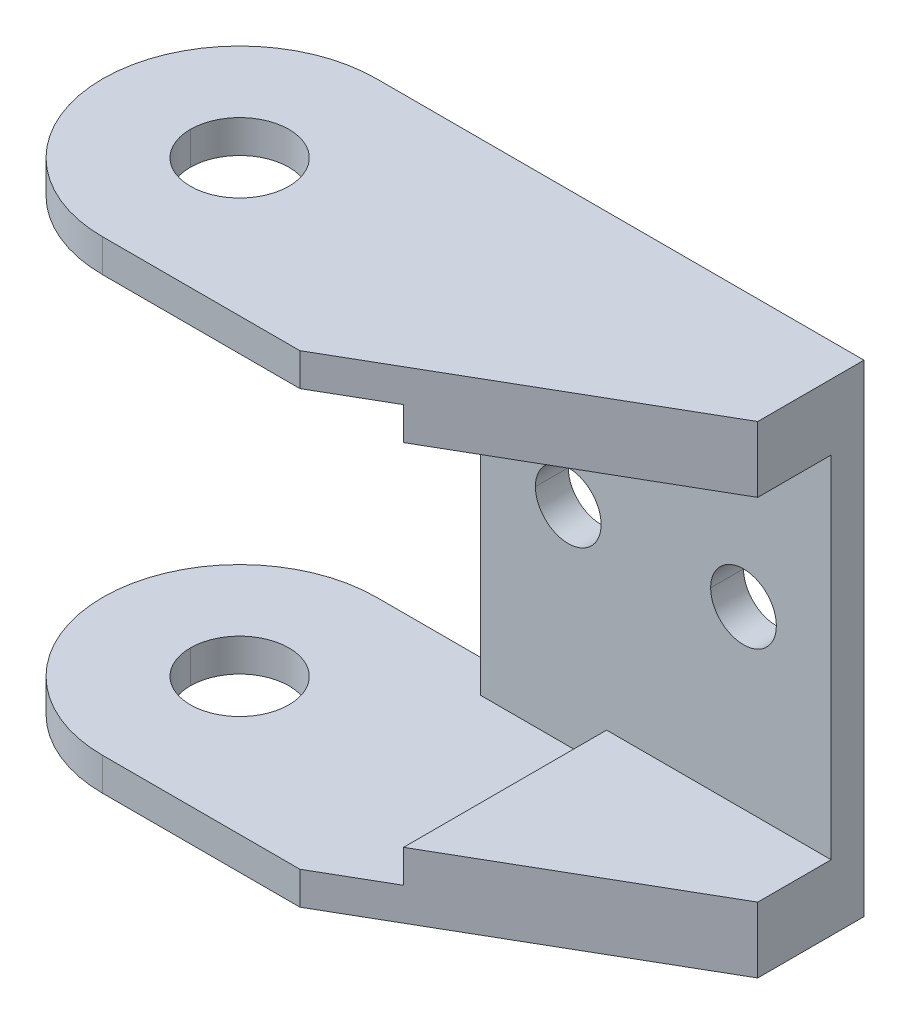
ISO-10303-21;
HEADER;
FILE_DESCRIPTION(('STEP AP214'),'2;1');
FILE_NAME('part.step','',(''),(''),'','','');
FILE_SCHEMA(('AUTOMOTIVE_DESIGN { 1 0 10303 214 1 1 1 1 }'));
ENDSEC;
DATA;
#1=APPLICATION_CONTEXT('core data for automotive mechanical design processes');
#2=APPLICATION_PROTOCOL_DEFINITION('international standard','automotive_design',2000,#1);
#3=PRODUCT_CONTEXT('',#1,'mechanical');
#4=PRODUCT('Part','Part','',(#3));
#5=PRODUCT_RELATED_PRODUCT_CATEGORY('part','',(#4));
#6=PRODUCT_DEFINITION_FORMATION('','',#4);
#7=PRODUCT_DEFINITION_CONTEXT('part definition',#1,'design');
#8=PRODUCT_DEFINITION('design','',#6,#7);
#9=PRODUCT_DEFINITION_SHAPE('','',#8);
#10=(LENGTH_UNIT() NAMED_UNIT(*) SI_UNIT(.MILLI.,.METRE.));
#11=(NAMED_UNIT(*) PLANE_ANGLE_UNIT() SI_UNIT($,.RADIAN.));
#12=(NAMED_UNIT(*) SI_UNIT($,.STERADIAN.) SOLID_ANGLE_UNIT());
#13=UNCERTAINTY_MEASURE_WITH_UNIT(LENGTH_MEASURE(1.E-05),#10,'distance_accuracy_value','');
#14=(GEOMETRIC_REPRESENTATION_CONTEXT(3) GLOBAL_UNCERTAINTY_ASSIGNED_CONTEXT((#13)) GLOBAL_UNIT_ASSIGNED_CONTEXT((#10,
#11,#12)) REPRESENTATION_CONTEXT('',''));
#15=CARTESIAN_POINT('',(0.,0.,0.));
#16=DIRECTION('',(0.,0.,1.));
#17=DIRECTION('',(1.,0.,0.));
#18=AXIS2_PLACEMENT_3D('',#15,#16,#17);
#19=CARTESIAN_POINT('',(0.,0.,0.));
#20=DIRECTION('',(0.,1.,0.));
#21=DIRECTION('',(1.,0.,0.));
#22=AXIS2_PLACEMENT_3D('',#19,#20,#21);
#23=CYLINDRICAL_SURFACE('',#22,2.25);
#24=DIRECTION('',(0.,-1.,0.));
#25=VECTOR('',#24,1.);
#26=CARTESIAN_POINT('',(2.25,-10.25,0.));
#27=LINE('',#26,#25);
#28=CARTESIAN_POINT('',(2.25,-9.5,0.));
#29=VERTEX_POINT('',#28);
#30=CARTESIAN_POINT('',(2.25,-11.,0.));
#31=VERTEX_POINT('',#30);
#32=EDGE_CURVE('E41',#29,#31,#27,.T.);
#33=ORIENTED_EDGE('',*,*,#32,.F.);
#34=CARTESIAN_POINT('',(0.,-9.5,0.));
#35=DIRECTION('',(0.,-1.,0.));
#36=DIRECTION('',(1.,0.,0.));
#37=AXIS2_PLACEMENT_3D('',#34,#35,#36);
#38=CIRCLE('',#37,2.25);
#39=CARTESIAN_POINT('',(-2.25,-9.5,0.));
#40=VERTEX_POINT('',#39);
#41=EDGE_CURVE('E281',#40,#29,#38,.T.);
#42=ORIENTED_EDGE('',*,*,#41,.F.);
#43=DIRECTION('',(0.,1.,0.));
#44=VECTOR('',#43,1.);
#45=CARTESIAN_POINT('',(-2.25,-10.25,0.));
#46=LINE('',#45,#44);
#47=CARTESIAN_POINT('',(-2.25,-11.,0.));
#48=VERTEX_POINT('',#47);
#49=EDGE_CURVE('E352',#48,#40,#46,.T.);
#50=ORIENTED_EDGE('',*,*,#49,.F.);
#51=CARTESIAN_POINT('',(0.,-11.,0.));
#52=DIRECTION('',(0.,1.,0.));
#53=DIRECTION('',(1.,0.,0.));
#54=AXIS2_PLACEMENT_3D('',#51,#52,#53);
#55=CIRCLE('',#54,2.25);
#56=EDGE_CURVE('E347',#31,#48,#55,.T.);
#57=ORIENTED_EDGE('',*,*,#56,.F.);
#58=EDGE_LOOP('',(#33,#42,#50,#57));
#59=FACE_BOUND('',#58,.T.);
#60=ADVANCED_FACE('F16',(#59),#23,.F.);
#61=CARTESIAN_POINT('',(0.,0.,0.));
#62=DIRECTION('',(0.,1.,0.));
#63=DIRECTION('',(1.,0.,0.));
#64=AXIS2_PLACEMENT_3D('',#61,#62,#63);
#65=CYLINDRICAL_SURFACE('',#64,2.25);
#66=DIRECTION('',(0.,-1.,0.));
#67=VECTOR('',#66,1.);
#68=CARTESIAN_POINT('',(2.25,10.25,0.));
#69=LINE('',#68,#67);
#70=CARTESIAN_POINT('',(2.25,11.,0.));
#71=VERTEX_POINT('',#70);
#72=CARTESIAN_POINT('',(2.25,9.5,0.));
#73=VERTEX_POINT('',#72);
#74=EDGE_CURVE('E257',#71,#73,#69,.T.);
#75=ORIENTED_EDGE('',*,*,#74,.F.);
#76=CARTESIAN_POINT('',(0.,11.,0.));
#77=DIRECTION('',(0.,-1.,0.));
#78=DIRECTION('',(1.,0.,0.));
#79=AXIS2_PLACEMENT_3D('',#76,#77,#78);
#80=CIRCLE('',#79,2.25);
#81=CARTESIAN_POINT('',(-2.25,11.,0.));
#82=VERTEX_POINT('',#81);
#83=EDGE_CURVE('E251',#82,#71,#80,.T.);
#84=ORIENTED_EDGE('',*,*,#83,.F.);
#85=DIRECTION('',(0.,1.,0.));
#86=VECTOR('',#85,1.);
#87=CARTESIAN_POINT('',(-2.25,10.25,0.));
#88=LINE('',#87,#86);
#89=CARTESIAN_POINT('',(-2.25,9.5,0.));
#90=VERTEX_POINT('',#89);
#91=EDGE_CURVE('E245',#90,#82,#88,.T.);
#92=ORIENTED_EDGE('',*,*,#91,.F.);
#93=CARTESIAN_POINT('',(0.,9.5,0.));
#94=DIRECTION('',(0.,1.,0.));
#95=DIRECTION('',(1.,0.,0.));
#96=AXIS2_PLACEMENT_3D('',#93,#94,#95);
#97=CIRCLE('',#96,2.25);
#98=EDGE_CURVE('E248',#73,#90,#97,.T.);
#99=ORIENTED_EDGE('',*,*,#98,.F.);
#100=EDGE_LOOP('',(#75,#84,#92,#99));
#101=FACE_BOUND('',#100,.T.);
#102=ADVANCED_FACE('F247',(#101),#65,.F.);
#103=CARTESIAN_POINT('',(18.25,0.,-5.5));
#104=DIRECTION('',(0.,0.,1.));
#105=DIRECTION('',(1.,0.,0.));
#106=AXIS2_PLACEMENT_3D('',#103,#104,#105);
#107=CYLINDRICAL_SURFACE('',#106,1.5);
#108=DIRECTION('',(0.,0.,-1.));
#109=VECTOR('',#108,1.);
#110=CARTESIAN_POINT('',(19.75,0.,-5.5));
#111=LINE('',#110,#109);
#112=CARTESIAN_POINT('',(19.75,0.,-4.75));
#113=VERTEX_POINT('',#112);
#114=CARTESIAN_POINT('',(19.75,0.,-6.25));
#115=VERTEX_POINT('',#114);
#116=EDGE_CURVE('E434',#113,#115,#111,.T.);
#117=ORIENTED_EDGE('',*,*,#116,.F.);
#118=CARTESIAN_POINT('',(18.25,0.,-4.75));
#119=DIRECTION('',(0.,0.,-1.));
#120=DIRECTION('',(1.,0.,0.));
#121=AXIS2_PLACEMENT_3D('',#118,#119,#120);
#122=CIRCLE('',#121,1.5);
#123=CARTESIAN_POINT('',(16.75,0.,-4.75));
#124=VERTEX_POINT('',#123);
#125=EDGE_CURVE('E20',#124,#113,#122,.T.);
#126=ORIENTED_EDGE('',*,*,#125,.F.);
#127=DIRECTION('',(0.,0.,1.));
#128=VECTOR('',#127,1.);
#129=CARTESIAN_POINT('',(16.75,0.,-5.5));
#130=LINE('',#129,#128);
#131=CARTESIAN_POINT('',(16.75,0.,-6.25));
#132=VERTEX_POINT('',#131);
#133=EDGE_CURVE('E308',#132,#124,#130,.T.);
#134=ORIENTED_EDGE('',*,*,#133,.F.);
#135=CARTESIAN_POINT('',(18.25,0.,-6.25));
#136=DIRECTION('',(0.,0.,1.));
#137=DIRECTION('',(1.,0.,0.));
#138=AXIS2_PLACEMENT_3D('',#135,#136,#137);
#139=CIRCLE('',#138,1.5);
#140=EDGE_CURVE('E336',#115,#132,#139,.T.);
#141=ORIENTED_EDGE('',*,*,#140,.F.);
#142=EDGE_LOOP('',(#117,#126,#134,#141));
#143=FACE_BOUND('',#142,.T.);
#144=ADVANCED_FACE('F834',(#143),#107,.F.);
#145=CARTESIAN_POINT('',(10.25,0.,-5.5));
#146=DIRECTION('',(0.,0.,1.));
#147=DIRECTION('',(1.,0.,0.));
#148=AXIS2_PLACEMENT_3D('',#145,#146,#147);
#149=CYLINDRICAL_SURFACE('',#148,1.5);
#150=DIRECTION('',(0.,0.,-1.));
#151=VECTOR('',#150,1.);
#152=CARTESIAN_POINT('',(11.75,0.,-5.5));
#153=LINE('',#152,#151);
#154=CARTESIAN_POINT('',(11.75,0.,-4.75));
#155=VERTEX_POINT('',#154);
#156=CARTESIAN_POINT('',(11.75,0.,-6.25));
#157=VERTEX_POINT('',#156);
#158=EDGE_CURVE('E11',#155,#157,#153,.T.);
#159=ORIENTED_EDGE('',*,*,#158,.F.);
#160=CARTESIAN_POINT('',(10.25,0.,-4.75));
#161=DIRECTION('',(0.,0.,-1.));
#162=DIRECTION('',(1.,0.,0.));
#163=AXIS2_PLACEMENT_3D('',#160,#161,#162);
#164=CIRCLE('',#163,1.5);
#165=CARTESIAN_POINT('',(8.75,0.,-4.75));
#166=VERTEX_POINT('',#165);
#167=EDGE_CURVE('E286',#166,#155,#164,.T.);
#168=ORIENTED_EDGE('',*,*,#167,.F.);
#169=DIRECTION('',(0.,0.,1.));
#170=VECTOR('',#169,1.);
#171=CARTESIAN_POINT('',(8.75,0.,-5.5));
#172=LINE('',#171,#170);
#173=CARTESIAN_POINT('',(8.75,0.,-6.25));
#174=VERTEX_POINT('',#173);
#175=EDGE_CURVE('E27',#174,#166,#172,.T.);
#176=ORIENTED_EDGE('',*,*,#175,.F.);
#177=CARTESIAN_POINT('',(10.25,0.,-6.25));
#178=DIRECTION('',(0.,0.,1.));
#179=DIRECTION('',(1.,0.,0.));
#180=AXIS2_PLACEMENT_3D('',#177,#178,#179);
#181=CIRCLE('',#180,1.5);
#182=EDGE_CURVE('E377',#157,#174,#181,.T.);
#183=ORIENTED_EDGE('',*,*,#182,.F.);
#184=EDGE_LOOP('',(#159,#168,#176,#183));
#185=FACE_BOUND('',#184,.T.);
#186=ADVANCED_FACE('F432',(#185),#149,.F.);
#187=CARTESIAN_POINT('',(10.25,0.,-5.5));
#188=DIRECTION('',(0.,0.,1.));
#189=DIRECTION('',(1.,0.,0.));
#190=AXIS2_PLACEMENT_3D('',#187,#188,#189);
#191=CYLINDRICAL_SURFACE('',#190,1.5);
#192=ORIENTED_EDGE('',*,*,#158,.T.);
#193=CARTESIAN_POINT('',(10.25,0.,-6.25));
#194=DIRECTION('',(0.,0.,1.));
#195=DIRECTION('',(1.,0.,0.));
#196=AXIS2_PLACEMENT_3D('',#193,#194,#195);
#197=CIRCLE('',#196,1.5);
#198=EDGE_CURVE('E381',#174,#157,#197,.T.);
#199=ORIENTED_EDGE('',*,*,#198,.F.);
#200=ORIENTED_EDGE('',*,*,#175,.T.);
#201=CARTESIAN_POINT('',(10.25,0.,-4.75));
#202=DIRECTION('',(0.,0.,-1.));
#203=DIRECTION('',(1.,0.,0.));
#204=AXIS2_PLACEMENT_3D('',#201,#202,#203);
#205=CIRCLE('',#204,1.5);
#206=EDGE_CURVE('E289',#155,#166,#205,.T.);
#207=ORIENTED_EDGE('',*,*,#206,.F.);
#208=EDGE_LOOP('',(#192,#199,#200,#207));
#209=FACE_BOUND('',#208,.T.);
#210=ADVANCED_FACE('F18',(#209),#191,.F.);
#211=CARTESIAN_POINT('',(18.25,0.,-5.5));
#212=DIRECTION('',(0.,0.,1.));
#213=DIRECTION('',(1.,0.,0.));
#214=AXIS2_PLACEMENT_3D('',#211,#212,#213);
#215=CYLINDRICAL_SURFACE('',#214,1.5);
#216=ORIENTED_EDGE('',*,*,#116,.T.);
#217=CARTESIAN_POINT('',(18.25,0.,-6.25));
#218=DIRECTION('',(0.,0.,1.));
#219=DIRECTION('',(1.,0.,0.));
#220=AXIS2_PLACEMENT_3D('',#217,#218,#219);
#221=CIRCLE('',#220,1.5);
#222=EDGE_CURVE('E332',#132,#115,#221,.T.);
#223=ORIENTED_EDGE('',*,*,#222,.F.);
#224=ORIENTED_EDGE('',*,*,#133,.T.);
#225=CARTESIAN_POINT('',(18.25,0.,-4.75));
#226=DIRECTION('',(0.,0.,-1.));
#227=DIRECTION('',(1.,0.,0.));
#228=AXIS2_PLACEMENT_3D('',#225,#226,#227);
#229=CIRCLE('',#228,1.5);
#230=EDGE_CURVE('E290',#113,#124,#229,.T.);
#231=ORIENTED_EDGE('',*,*,#230,.F.);
#232=EDGE_LOOP('',(#216,#223,#224,#231));
#233=FACE_BOUND('',#232,.T.);
#234=ADVANCED_FACE('F930',(#233),#215,.F.);
#235=CARTESIAN_POINT('',(14.25,-9.5,-4.75));
#236=DIRECTION('',(0.,0.,1.));
#237=DIRECTION('',(1.,0.,0.));
#238=AXIS2_PLACEMENT_3D('',#235,#236,#237);
#239=PLANE('',#238);
#240=DIRECTION('',(0.,-1.,0.));
#241=VECTOR('',#240,1.);
#242=CARTESIAN_POINT('',(12.,-4.75,-4.75));
#243=LINE('',#242,#241);
#244=CARTESIAN_POINT('',(12.,9.5,-4.75));
#245=VERTEX_POINT('',#244);
#246=CARTESIAN_POINT('',(12.,8.,-4.75));
#247=VERTEX_POINT('',#246);
#248=EDGE_CURVE('E264',#245,#247,#243,.T.);
#249=ORIENTED_EDGE('',*,*,#248,.F.);
#250=DIRECTION('',(1.,0.,0.));
#251=VECTOR('',#250,1.);
#252=CARTESIAN_POINT('',(8.5625,9.5,-4.75));
#253=LINE('',#252,#251);
#254=CARTESIAN_POINT('',(6.25,9.5,-4.75));
#255=VERTEX_POINT('',#254);
#256=EDGE_CURVE('E268',#255,#245,#253,.T.);
#257=ORIENTED_EDGE('',*,*,#256,.F.);
#258=DIRECTION('',(0.,1.,0.));
#259=VECTOR('',#258,1.);
#260=CARTESIAN_POINT('',(6.25,-9.5,-4.75));
#261=LINE('',#260,#259);
#262=CARTESIAN_POINT('',(6.25,-9.5,-4.75));
#263=VERTEX_POINT('',#262);
#264=EDGE_CURVE('E484',#263,#255,#261,.T.);
#265=ORIENTED_EDGE('',*,*,#264,.F.);
#266=DIRECTION('',(-1.,0.,0.));
#267=VECTOR('',#266,1.);
#268=CARTESIAN_POINT('',(8.5625,-9.5,-4.75));
#269=LINE('',#268,#267);
#270=CARTESIAN_POINT('',(12.,-9.5,-4.75));
#271=VERTEX_POINT('',#270);
#272=EDGE_CURVE('E209',#271,#263,#269,.T.);
#273=ORIENTED_EDGE('',*,*,#272,.F.);
#274=DIRECTION('',(0.,-1.,0.));
#275=VECTOR('',#274,1.);
#276=CARTESIAN_POINT('',(12.,-4.75,-4.75));
#277=LINE('',#276,#275);
#278=CARTESIAN_POINT('',(12.,-8.,-4.75));
#279=VERTEX_POINT('',#278);
#280=EDGE_CURVE('E221',#279,#271,#277,.T.);
#281=ORIENTED_EDGE('',*,*,#280,.F.);
#282=DIRECTION('',(-1.,0.,0.));
#283=VECTOR('',#282,1.);
#284=CARTESIAN_POINT('',(12.625,-8.,-4.75));
#285=LINE('',#284,#283);
#286=CARTESIAN_POINT('',(22.25,-8.,-4.75));
#287=VERTEX_POINT('',#286);
#288=EDGE_CURVE('E258',#287,#279,#285,.T.);
#289=ORIENTED_EDGE('',*,*,#288,.F.);
#290=DIRECTION('',(0.,1.,0.));
#291=VECTOR('',#290,1.);
#292=CARTESIAN_POINT('',(22.25,-9.5,-4.75));
#293=LINE('',#292,#291);
#294=CARTESIAN_POINT('',(22.25,8.,-4.75));
#295=VERTEX_POINT('',#294);
#296=EDGE_CURVE('E304',#287,#295,#293,.T.);
#297=ORIENTED_EDGE('',*,*,#296,.T.);
#298=DIRECTION('',(1.,0.,0.));
#299=VECTOR('',#298,1.);
#300=CARTESIAN_POINT('',(12.625,8.,-4.75));
#301=LINE('',#300,#299);
#302=EDGE_CURVE('E298',#247,#295,#301,.T.);
#303=ORIENTED_EDGE('',*,*,#302,.F.);
#304=EDGE_LOOP('',(#249,#257,#265,#273,#281,#289,#297,#303));
#305=FACE_BOUND('',#304,.T.);
#306=ORIENTED_EDGE('',*,*,#206,.T.);
#307=ORIENTED_EDGE('',*,*,#167,.T.);
#308=EDGE_LOOP('',(#306,#307));
#309=FACE_BOUND('',#308,.T.);
#310=ORIENTED_EDGE('',*,*,#230,.T.);
#311=ORIENTED_EDGE('',*,*,#125,.T.);
#312=EDGE_LOOP('',(#310,#311));
#313=FACE_BOUND('',#312,.T.);
#314=ADVANCED_FACE('F539',(#305,#309,#313),#239,.T.);
#315=CARTESIAN_POINT('',(6.25,-9.5,-5.5));
#316=DIRECTION('',(-1.,0.,0.));
#317=DIRECTION('',(0.,0.,1.));
#318=AXIS2_PLACEMENT_3D('',#315,#316,#317);
#319=PLANE('',#318);
#320=ORIENTED_EDGE('',*,*,#264,.T.);
#321=DIRECTION('',(0.,0.,1.));
#322=VECTOR('',#321,1.);
#323=CARTESIAN_POINT('',(6.25,9.5,-2.75));
#324=LINE('',#323,#322);
#325=CARTESIAN_POINT('',(6.25,9.5,-6.25));
#326=VERTEX_POINT('',#325);
#327=EDGE_CURVE('E275',#326,#255,#324,.T.);
#328=ORIENTED_EDGE('',*,*,#327,.F.);
#329=DIRECTION('',(0.,1.,0.));
#330=VECTOR('',#329,1.);
#331=CARTESIAN_POINT('',(6.25,-9.5,-6.25));
#332=LINE('',#331,#330);
#333=CARTESIAN_POINT('',(6.25,-9.5,-6.25));
#334=VERTEX_POINT('',#333);
#335=EDGE_CURVE('E361',#334,#326,#332,.T.);
#336=ORIENTED_EDGE('',*,*,#335,.F.);
#337=DIRECTION('',(0.,0.,-1.));
#338=VECTOR('',#337,1.);
#339=CARTESIAN_POINT('',(6.25,-9.5,-2.75));
#340=LINE('',#339,#338);
#341=EDGE_CURVE('E284',#263,#334,#340,.T.);
#342=ORIENTED_EDGE('',*,*,#341,.F.);
#343=EDGE_LOOP('',(#320,#328,#336,#342));
#344=FACE_BOUND('',#343,.T.);
#345=ADVANCED_FACE('F501',(#344),#319,.T.);
#346=CARTESIAN_POINT('',(2.875,9.5,0.));
#347=DIRECTION('',(0.,-1.,0.));
#348=DIRECTION('',(0.,0.,-1.));
#349=AXIS2_PLACEMENT_3D('',#346,#347,#348);
#350=PLANE('',#349);
#351=ORIENTED_EDGE('',*,*,#327,.T.);
#352=ORIENTED_EDGE('',*,*,#256,.T.);
#353=DIRECTION('',(0.,0.,-1.));
#354=VECTOR('',#353,1.);
#355=CARTESIAN_POINT('',(12.,9.5,0.));
#356=LINE('',#355,#354);
#357=CARTESIAN_POINT('',(12.,9.5,4.51794919242264));
#358=VERTEX_POINT('',#357);
#359=EDGE_CURVE('E293',#358,#245,#356,.T.);
#360=ORIENTED_EDGE('',*,*,#359,.F.);
#361=DIRECTION('',(0.866025403783379,0.,-0.500000000001836));
#362=VECTOR('',#361,1.);
#363=CARTESIAN_POINT('',(11.3687896934221,9.5,4.88237863284243));
#364=LINE('',#363,#362);
#365=CARTESIAN_POINT('',(9.,9.5,6.25));
#366=VERTEX_POINT('',#365);
#367=EDGE_CURVE('E358',#366,#358,#364,.T.);
#368=ORIENTED_EDGE('',*,*,#367,.F.);
#369=DIRECTION('',(1.,0.,0.));
#370=VECTOR('',#369,1.);
#371=CARTESIAN_POINT('',(3.6875,9.5,6.25));
#372=LINE('',#371,#370);
#373=CARTESIAN_POINT('',(0.,9.5,6.25));
#374=VERTEX_POINT('',#373);
#375=EDGE_CURVE('E324',#374,#366,#372,.T.);
#376=ORIENTED_EDGE('',*,*,#375,.F.);
#377=CARTESIAN_POINT('',(0.,9.5,0.));
#378=DIRECTION('',(0.,1.,0.));
#379=DIRECTION('',(0.,0.,1.));
#380=AXIS2_PLACEMENT_3D('',#377,#378,#379);
#381=CIRCLE('',#380,6.25);
#382=CARTESIAN_POINT('',(0.,9.5,-6.25));
#383=VERTEX_POINT('',#382);
#384=EDGE_CURVE('E337',#383,#374,#381,.T.);
#385=ORIENTED_EDGE('',*,*,#384,.F.);
#386=DIRECTION('',(-1.,0.,0.));
#387=VECTOR('',#386,1.);
#388=CARTESIAN_POINT('',(7.,9.5,-6.25));
#389=LINE('',#388,#387);
#390=EDGE_CURVE('E364',#326,#383,#389,.T.);
#391=ORIENTED_EDGE('',*,*,#390,.F.);
#392=EDGE_LOOP('',(#351,#352,#360,#368,#376,#385,#391));
#393=FACE_BOUND('',#392,.T.);
#394=CARTESIAN_POINT('',(0.,9.5,0.));
#395=DIRECTION('',(0.,1.,0.));
#396=DIRECTION('',(1.,0.,0.));
#397=AXIS2_PLACEMENT_3D('',#394,#395,#396);
#398=CIRCLE('',#397,2.25);
#399=EDGE_CURVE('E262',#90,#73,#398,.T.);
#400=ORIENTED_EDGE('',*,*,#399,.T.);
#401=ORIENTED_EDGE('',*,*,#98,.T.);
#402=EDGE_LOOP('',(#400,#401));
#403=FACE_BOUND('',#402,.T.);
#404=ADVANCED_FACE('F261',(#393,#403),#350,.T.);
#405=CARTESIAN_POINT('',(12.,0.,0.));
#406=DIRECTION('',(-1.,0.,0.));
#407=DIRECTION('',(0.,0.,1.));
#408=AXIS2_PLACEMENT_3D('',#405,#406,#407);
#409=PLANE('',#408);
#410=ORIENTED_EDGE('',*,*,#248,.T.);
#411=DIRECTION('',(0.,0.,1.));
#412=VECTOR('',#411,1.);
#413=CARTESIAN_POINT('',(12.,8.,0.));
#414=LINE('',#413,#412);
#415=CARTESIAN_POINT('',(12.,8.,4.51794919242264));
#416=VERTEX_POINT('',#415);
#417=EDGE_CURVE('E297',#247,#416,#414,.T.);
#418=ORIENTED_EDGE('',*,*,#417,.T.);
#419=DIRECTION('',(0.,-1.,0.));
#420=VECTOR('',#419,1.);
#421=CARTESIAN_POINT('',(12.,-5.5,4.51794919242264));
#422=LINE('',#421,#420);
#423=EDGE_CURVE('E341',#358,#416,#422,.T.);
#424=ORIENTED_EDGE('',*,*,#423,.F.);
#425=ORIENTED_EDGE('',*,*,#359,.T.);
#426=EDGE_LOOP('',(#410,#418,#424,#425));
#427=FACE_BOUND('',#426,.T.);
#428=ADVANCED_FACE('F788',(#427),#409,.T.);
#429=CARTESIAN_POINT('',(11.,8.,0.));
#430=DIRECTION('',(0.,-1.,0.));
#431=DIRECTION('',(0.,0.,-1.));
#432=AXIS2_PLACEMENT_3D('',#429,#430,#431);
#433=PLANE('',#432);
#434=ORIENTED_EDGE('',*,*,#302,.T.);
#435=DIRECTION('',(0.,0.,-1.));
#436=VECTOR('',#435,1.);
#437=CARTESIAN_POINT('',(22.25,8.,-1.9124727667));
#438=LINE('',#437,#436);
#439=CARTESIAN_POINT('',(22.25,8.,-1.3998910668));
#440=VERTEX_POINT('',#439);
#441=EDGE_CURVE('E371',#440,#295,#438,.T.);
#442=ORIENTED_EDGE('',*,*,#441,.F.);
#443=DIRECTION('',(0.866025403783379,0.,-0.500000000001836));
#444=VECTOR('',#443,1.);
#445=CARTESIAN_POINT('',(14.4156646934147,8.,3.12326453140098));
#446=LINE('',#445,#444);
#447=EDGE_CURVE('E319',#416,#440,#446,.T.);
#448=ORIENTED_EDGE('',*,*,#447,.F.);
#449=ORIENTED_EDGE('',*,*,#417,.F.);
#450=EDGE_LOOP('',(#434,#442,#448,#449));
#451=FACE_BOUND('',#450,.T.);
#452=ADVANCED_FACE('F545',(#451),#433,.T.);
#453=CARTESIAN_POINT('',(15.625,-11.,2.4250544666));
#454=DIRECTION('',(0.500000000001836,0.,0.866025403783379));
#455=DIRECTION('',(0.,-1.,0.));
#456=AXIS2_PLACEMENT_3D('',#453,#454,#455);
#457=PLANE('',#456);
#458=ORIENTED_EDGE('',*,*,#447,.T.);
#459=DIRECTION('',(0.,1.,0.));
#460=VECTOR('',#459,1.);
#461=CARTESIAN_POINT('',(22.25,-11.,-1.3998910668));
#462=LINE('',#461,#460);
#463=CARTESIAN_POINT('',(22.25,11.,-1.3998910668));
#464=VERTEX_POINT('',#463);
#465=EDGE_CURVE('E315',#440,#464,#462,.T.);
#466=ORIENTED_EDGE('',*,*,#465,.T.);
#467=DIRECTION('',(-0.866025403783379,0.,0.500000000001836));
#468=VECTOR('',#467,1.);
#469=CARTESIAN_POINT('',(22.25,11.,-1.3998910668));
#470=LINE('',#469,#468);
#471=CARTESIAN_POINT('',(9.,11.,6.25));
#472=VERTEX_POINT('',#471);
#473=EDGE_CURVE('E320',#464,#472,#470,.T.);
#474=ORIENTED_EDGE('',*,*,#473,.T.);
#475=DIRECTION('',(0.,1.,0.));
#476=VECTOR('',#475,1.);
#477=CARTESIAN_POINT('',(9.,-11.,6.25));
#478=LINE('',#477,#476);
#479=EDGE_CURVE('E321',#366,#472,#478,.T.);
#480=ORIENTED_EDGE('',*,*,#479,.F.);
#481=ORIENTED_EDGE('',*,*,#367,.T.);
#482=ORIENTED_EDGE('',*,*,#423,.T.);
#483=EDGE_LOOP('',(#458,#466,#474,#480,#481,#482));
#484=FACE_BOUND('',#483,.T.);
#485=ADVANCED_FACE('F548',(#484),#457,.T.);
#486=CARTESIAN_POINT('',(0.,-11.,0.));
#487=DIRECTION('',(0.,1.,0.));
#488=DIRECTION('',(0.,0.,1.));
#489=AXIS2_PLACEMENT_3D('',#486,#487,#488);
#490=CYLINDRICAL_SURFACE('',#489,6.25);
#491=ORIENTED_EDGE('',*,*,#384,.T.);
#492=DIRECTION('',(0.,1.,0.));
#493=VECTOR('',#492,1.);
#494=CARTESIAN_POINT('',(0.,-11.,6.25));
#495=LINE('',#494,#493);
#496=CARTESIAN_POINT('',(0.,11.,6.25));
#497=VERTEX_POINT('',#496);
#498=EDGE_CURVE('E342',#374,#497,#495,.T.);
#499=ORIENTED_EDGE('',*,*,#498,.T.);
#500=CARTESIAN_POINT('',(0.,11.,0.));
#501=DIRECTION('',(0.,-1.,0.));
#502=DIRECTION('',(0.,0.,1.));
#503=AXIS2_PLACEMENT_3D('',#500,#501,#502);
#504=CIRCLE('',#503,6.25);
#505=CARTESIAN_POINT('',(0.,11.,-6.25));
#506=VERTEX_POINT('',#505);
#507=EDGE_CURVE('E455',#497,#506,#504,.T.);
#508=ORIENTED_EDGE('',*,*,#507,.T.);
#509=DIRECTION('',(0.,1.,0.));
#510=VECTOR('',#509,1.);
#511=CARTESIAN_POINT('',(0.,-11.,-6.25));
#512=LINE('',#511,#510);
#513=EDGE_CURVE('E407',#383,#506,#512,.T.);
#514=ORIENTED_EDGE('',*,*,#513,.F.);
#515=EDGE_LOOP('',(#491,#499,#508,#514));
#516=FACE_BOUND('',#515,.T.);
#517=ADVANCED_FACE('F810',(#516),#490,.T.);
#518=CARTESIAN_POINT('',(4.5,-11.,6.25));
#519=DIRECTION('',(0.,0.,1.));
#520=DIRECTION('',(1.,0.,0.));
#521=AXIS2_PLACEMENT_3D('',#518,#519,#520);
#522=PLANE('',#521);
#523=ORIENTED_EDGE('',*,*,#375,.T.);
#524=ORIENTED_EDGE('',*,*,#479,.T.);
#525=DIRECTION('',(-1.,0.,0.));
#526=VECTOR('',#525,1.);
#527=CARTESIAN_POINT('',(9.,11.,6.25));
#528=LINE('',#527,#526);
#529=EDGE_CURVE('E325',#472,#497,#528,.T.);
#530=ORIENTED_EDGE('',*,*,#529,.T.);
#531=ORIENTED_EDGE('',*,*,#498,.F.);
#532=EDGE_LOOP('',(#523,#524,#530,#531));
#533=FACE_BOUND('',#532,.T.);
#534=ADVANCED_FACE('F815',(#533),#522,.T.);
#535=CARTESIAN_POINT('',(7.94775638312467,11.,-0.904641903031862));
#536=DIRECTION('',(0.,-1.,0.));
#537=DIRECTION('',(0.,0.,-1.));
#538=AXIS2_PLACEMENT_3D('',#535,#536,#537);
#539=PLANE('',#538);
#540=DIRECTION('',(1.,0.,0.));
#541=VECTOR('',#540,1.);
#542=CARTESIAN_POINT('',(0.,11.,-6.25));
#543=LINE('',#542,#541);
#544=CARTESIAN_POINT('',(22.25,11.,-6.25));
#545=VERTEX_POINT('',#544);
#546=EDGE_CURVE('E380',#506,#545,#543,.T.);
#547=ORIENTED_EDGE('',*,*,#546,.F.);
#548=ORIENTED_EDGE('',*,*,#507,.F.);
#549=ORIENTED_EDGE('',*,*,#529,.F.);
#550=ORIENTED_EDGE('',*,*,#473,.F.);
#551=DIRECTION('',(0.,0.,1.));
#552=VECTOR('',#551,1.);
#553=CARTESIAN_POINT('',(22.25,11.,-6.25));
#554=LINE('',#553,#552);
#555=EDGE_CURVE('E375',#545,#464,#554,.T.);
#556=ORIENTED_EDGE('',*,*,#555,.F.);
#557=EDGE_LOOP('',(#547,#548,#549,#550,#556));
#558=FACE_BOUND('',#557,.T.);
#559=CARTESIAN_POINT('',(0.,11.,0.));
#560=DIRECTION('',(0.,-1.,0.));
#561=DIRECTION('',(1.,0.,0.));
#562=AXIS2_PLACEMENT_3D('',#559,#560,#561);
#563=CIRCLE('',#562,2.25);
#564=EDGE_CURVE('E353',#71,#82,#563,.T.);
#565=ORIENTED_EDGE('',*,*,#564,.T.);
#566=ORIENTED_EDGE('',*,*,#83,.T.);
#567=EDGE_LOOP('',(#565,#566));
#568=FACE_BOUND('',#567,.T.);
#569=ADVANCED_FACE('F827',(#558,#568),#539,.F.);
#570=CARTESIAN_POINT('',(0.,0.,0.));
#571=DIRECTION('',(0.,1.,0.));
#572=DIRECTION('',(1.,0.,0.));
#573=AXIS2_PLACEMENT_3D('',#570,#571,#572);
#574=CYLINDRICAL_SURFACE('',#573,2.25);
#575=ORIENTED_EDGE('',*,*,#74,.T.);
#576=ORIENTED_EDGE('',*,*,#399,.F.);
#577=ORIENTED_EDGE('',*,*,#91,.T.);
#578=ORIENTED_EDGE('',*,*,#564,.F.);
#579=EDGE_LOOP('',(#575,#576,#577,#578));
#580=FACE_BOUND('',#579,.T.);
#581=ADVANCED_FACE('F266',(#580),#574,.F.);
#582=CARTESIAN_POINT('',(11.,-8.,0.));
#583=DIRECTION('',(0.,-1.,0.));
#584=DIRECTION('',(0.,0.,-1.));
#585=AXIS2_PLACEMENT_3D('',#582,#583,#584);
#586=PLANE('',#585);
#587=ORIENTED_EDGE('',*,*,#288,.T.);
#588=DIRECTION('',(0.,0.,-1.));
#589=VECTOR('',#588,1.);
#590=CARTESIAN_POINT('',(12.,-8.,0.));
#591=LINE('',#590,#589);
#592=CARTESIAN_POINT('',(12.,-8.,4.51794919242264));
#593=VERTEX_POINT('',#592);
#594=EDGE_CURVE('E389',#593,#279,#591,.T.);
#595=ORIENTED_EDGE('',*,*,#594,.F.);
#596=DIRECTION('',(-0.866025403783379,0.,0.500000000001836));
#597=VECTOR('',#596,1.);
#598=CARTESIAN_POINT('',(14.4156646934147,-8.,3.12326453140098));
#599=LINE('',#598,#597);
#600=CARTESIAN_POINT('',(22.25,-8.,-1.3998910668));
#601=VERTEX_POINT('',#600);
#602=EDGE_CURVE('E386',#601,#593,#599,.T.);
#603=ORIENTED_EDGE('',*,*,#602,.F.);
#604=DIRECTION('',(0.,0.,1.));
#605=VECTOR('',#604,1.);
#606=CARTESIAN_POINT('',(22.25,-8.,-1.9124727667));
#607=LINE('',#606,#605);
#608=EDGE_CURVE('E376',#287,#601,#607,.T.);
#609=ORIENTED_EDGE('',*,*,#608,.F.);
#610=EDGE_LOOP('',(#587,#595,#603,#609));
#611=FACE_BOUND('',#610,.T.);
#612=ADVANCED_FACE('F537',(#611),#586,.F.);
#613=CARTESIAN_POINT('',(2.875,-9.5,0.));
#614=DIRECTION('',(0.,-1.,0.));
#615=DIRECTION('',(0.,0.,-1.));
#616=AXIS2_PLACEMENT_3D('',#613,#614,#615);
#617=PLANE('',#616);
#618=ORIENTED_EDGE('',*,*,#272,.T.);
#619=ORIENTED_EDGE('',*,*,#341,.T.);
#620=DIRECTION('',(1.,0.,0.));
#621=VECTOR('',#620,1.);
#622=CARTESIAN_POINT('',(7.,-9.5,-6.25));
#623=LINE('',#622,#621);
#624=CARTESIAN_POINT('',(0.,-9.5,-6.25));
#625=VERTEX_POINT('',#624);
#626=EDGE_CURVE('E363',#625,#334,#623,.T.);
#627=ORIENTED_EDGE('',*,*,#626,.F.);
#628=CARTESIAN_POINT('',(0.,-9.5,0.));
#629=DIRECTION('',(0.,-1.,0.));
#630=DIRECTION('',(0.,0.,1.));
#631=AXIS2_PLACEMENT_3D('',#628,#629,#630);
#632=CIRCLE('',#631,6.25);
#633=CARTESIAN_POINT('',(0.,-9.5,6.25));
#634=VERTEX_POINT('',#633);
#635=EDGE_CURVE('E348',#634,#625,#632,.T.);
#636=ORIENTED_EDGE('',*,*,#635,.F.);
#637=DIRECTION('',(-1.,0.,0.));
#638=VECTOR('',#637,1.);
#639=CARTESIAN_POINT('',(3.6875,-9.5,6.25));
#640=LINE('',#639,#638);
#641=CARTESIAN_POINT('',(9.,-9.5,6.25));
#642=VERTEX_POINT('',#641);
#643=EDGE_CURVE('E417',#642,#634,#640,.T.);
#644=ORIENTED_EDGE('',*,*,#643,.F.);
#645=DIRECTION('',(-0.866025403783379,0.,0.500000000001836));
#646=VECTOR('',#645,1.);
#647=CARTESIAN_POINT('',(11.3687896934221,-9.5,4.88237863284243));
#648=LINE('',#647,#646);
#649=CARTESIAN_POINT('',(12.,-9.5,4.51794919242264));
#650=VERTEX_POINT('',#649);
#651=EDGE_CURVE('E303',#650,#642,#648,.T.);
#652=ORIENTED_EDGE('',*,*,#651,.F.);
#653=DIRECTION('',(0.,0.,1.));
#654=VECTOR('',#653,1.);
#655=CARTESIAN_POINT('',(12.,-9.5,0.));
#656=LINE('',#655,#654);
#657=EDGE_CURVE('E367',#271,#650,#656,.T.);
#658=ORIENTED_EDGE('',*,*,#657,.F.);
#659=EDGE_LOOP('',(#618,#619,#627,#636,#644,#652,#658));
#660=FACE_BOUND('',#659,.T.);
#661=ORIENTED_EDGE('',*,*,#41,.T.);
#662=CARTESIAN_POINT('',(0.,-9.5,0.));
#663=DIRECTION('',(0.,-1.,0.));
#664=DIRECTION('',(1.,0.,0.));
#665=AXIS2_PLACEMENT_3D('',#662,#663,#664);
#666=CIRCLE('',#665,2.25);
#667=EDGE_CURVE('E285',#29,#40,#666,.T.);
#668=ORIENTED_EDGE('',*,*,#667,.T.);
#669=EDGE_LOOP('',(#661,#668));
#670=FACE_BOUND('',#669,.T.);
#671=ADVANCED_FACE('F503',(#660,#670),#617,.F.);
#672=CARTESIAN_POINT('',(0.,0.,0.));
#673=DIRECTION('',(0.,1.,0.));
#674=DIRECTION('',(1.,0.,0.));
#675=AXIS2_PLACEMENT_3D('',#672,#673,#674);
#676=CYLINDRICAL_SURFACE('',#675,2.25);
#677=ORIENTED_EDGE('',*,*,#32,.T.);
#678=CARTESIAN_POINT('',(0.,-11.,0.));
#679=DIRECTION('',(0.,1.,0.));
#680=DIRECTION('',(1.,0.,0.));
#681=AXIS2_PLACEMENT_3D('',#678,#679,#680);
#682=CIRCLE('',#681,2.25);
#683=EDGE_CURVE('E343',#48,#31,#682,.T.);
#684=ORIENTED_EDGE('',*,*,#683,.F.);
#685=ORIENTED_EDGE('',*,*,#49,.T.);
#686=ORIENTED_EDGE('',*,*,#667,.F.);
#687=EDGE_LOOP('',(#677,#684,#685,#686));
#688=FACE_BOUND('',#687,.T.);
#689=ADVANCED_FACE('F770',(#688),#676,.F.);
#690=CARTESIAN_POINT('',(7.94775638312467,-11.,-0.904641903031862));
#691=DIRECTION('',(0.,-1.,0.));
#692=DIRECTION('',(0.,0.,-1.));
#693=AXIS2_PLACEMENT_3D('',#690,#691,#692);
#694=PLANE('',#693);
#695=CARTESIAN_POINT('',(0.,-11.,0.));
#696=DIRECTION('',(0.,-1.,0.));
#697=DIRECTION('',(0.,0.,1.));
#698=AXIS2_PLACEMENT_3D('',#695,#696,#697);
#699=CIRCLE('',#698,6.25);
#700=CARTESIAN_POINT('',(0.,-11.,6.25));
#701=VERTEX_POINT('',#700);
#702=CARTESIAN_POINT('',(0.,-11.,-6.25));
#703=VERTEX_POINT('',#702);
#704=EDGE_CURVE('E330',#701,#703,#699,.T.);
#705=ORIENTED_EDGE('',*,*,#704,.T.);
#706=DIRECTION('',(1.,0.,0.));
#707=VECTOR('',#706,1.);
#708=CARTESIAN_POINT('',(0.,-11.,-6.25));
#709=LINE('',#708,#707);
#710=CARTESIAN_POINT('',(22.25,-11.,-6.25));
#711=VERTEX_POINT('',#710);
#712=EDGE_CURVE('E326',#703,#711,#709,.T.);
#713=ORIENTED_EDGE('',*,*,#712,.T.);
#714=DIRECTION('',(0.,0.,1.));
#715=VECTOR('',#714,1.);
#716=CARTESIAN_POINT('',(22.25,-11.,-6.25));
#717=LINE('',#716,#715);
#718=CARTESIAN_POINT('',(22.25,-11.,-1.3998910668));
#719=VERTEX_POINT('',#718);
#720=EDGE_CURVE('E331',#711,#719,#717,.T.);
#721=ORIENTED_EDGE('',*,*,#720,.T.);
#722=DIRECTION('',(-0.866025403783379,0.,0.500000000001836));
#723=VECTOR('',#722,1.);
#724=CARTESIAN_POINT('',(22.25,-11.,-1.3998910668));
#725=LINE('',#724,#723);
#726=CARTESIAN_POINT('',(9.,-11.,6.25));
#727=VERTEX_POINT('',#726);
#728=EDGE_CURVE('E481',#719,#727,#725,.T.);
#729=ORIENTED_EDGE('',*,*,#728,.T.);
#730=DIRECTION('',(-1.,0.,0.));
#731=VECTOR('',#730,1.);
#732=CARTESIAN_POINT('',(9.,-11.,6.25));
#733=LINE('',#732,#731);
#734=EDGE_CURVE('E392',#727,#701,#733,.T.);
#735=ORIENTED_EDGE('',*,*,#734,.T.);
#736=EDGE_LOOP('',(#705,#713,#721,#729,#735));
#737=FACE_BOUND('',#736,.T.);
#738=ORIENTED_EDGE('',*,*,#56,.T.);
#739=ORIENTED_EDGE('',*,*,#683,.T.);
#740=EDGE_LOOP('',(#738,#739));
#741=FACE_BOUND('',#740,.T.);
#742=ADVANCED_FACE('F531',(#737,#741),#694,.T.);
#743=CARTESIAN_POINT('',(0.,-11.,0.));
#744=DIRECTION('',(0.,1.,0.));
#745=DIRECTION('',(0.,0.,1.));
#746=AXIS2_PLACEMENT_3D('',#743,#744,#745);
#747=CYLINDRICAL_SURFACE('',#746,6.25);
#748=ORIENTED_EDGE('',*,*,#635,.T.);
#749=DIRECTION('',(0.,1.,0.));
#750=VECTOR('',#749,1.);
#751=CARTESIAN_POINT('',(0.,-11.,-6.25));
#752=LINE('',#751,#750);
#753=EDGE_CURVE('E279',#703,#625,#752,.T.);
#754=ORIENTED_EDGE('',*,*,#753,.F.);
#755=ORIENTED_EDGE('',*,*,#704,.F.);
#756=DIRECTION('',(0.,1.,0.));
#757=VECTOR('',#756,1.);
#758=CARTESIAN_POINT('',(0.,-11.,6.25));
#759=LINE('',#758,#757);
#760=EDGE_CURVE('E396',#701,#634,#759,.T.);
#761=ORIENTED_EDGE('',*,*,#760,.T.);
#762=EDGE_LOOP('',(#748,#754,#755,#761));
#763=FACE_BOUND('',#762,.T.);
#764=ADVANCED_FACE('F859',(#763),#747,.T.);
#765=CARTESIAN_POINT('',(4.5,-11.,6.25));
#766=DIRECTION('',(0.,0.,1.));
#767=DIRECTION('',(1.,0.,0.));
#768=AXIS2_PLACEMENT_3D('',#765,#766,#767);
#769=PLANE('',#768);
#770=ORIENTED_EDGE('',*,*,#643,.T.);
#771=ORIENTED_EDGE('',*,*,#760,.F.);
#772=ORIENTED_EDGE('',*,*,#734,.F.);
#773=DIRECTION('',(0.,1.,0.));
#774=VECTOR('',#773,1.);
#775=CARTESIAN_POINT('',(9.,-11.,6.25));
#776=LINE('',#775,#774);
#777=EDGE_CURVE('E445',#727,#642,#776,.T.);
#778=ORIENTED_EDGE('',*,*,#777,.T.);
#779=EDGE_LOOP('',(#770,#771,#772,#778));
#780=FACE_BOUND('',#779,.T.);
#781=ADVANCED_FACE('F866',(#780),#769,.T.);
#782=CARTESIAN_POINT('',(22.25,-11.,-3.8249455334));
#783=DIRECTION('',(1.,0.,0.));
#784=DIRECTION('',(0.,1.,0.));
#785=AXIS2_PLACEMENT_3D('',#782,#783,#784);
#786=PLANE('',#785);
#787=DIRECTION('',(0.,1.,0.));
#788=VECTOR('',#787,1.);
#789=CARTESIAN_POINT('',(22.25,-11.,-6.25));
#790=LINE('',#789,#788);
#791=EDGE_CURVE('E385',#711,#545,#790,.T.);
#792=ORIENTED_EDGE('',*,*,#791,.T.);
#793=ORIENTED_EDGE('',*,*,#555,.T.);
#794=ORIENTED_EDGE('',*,*,#465,.F.);
#795=ORIENTED_EDGE('',*,*,#441,.T.);
#796=ORIENTED_EDGE('',*,*,#296,.F.);
#797=ORIENTED_EDGE('',*,*,#608,.T.);
#798=DIRECTION('',(0.,1.,0.));
#799=VECTOR('',#798,1.);
#800=CARTESIAN_POINT('',(22.25,-11.,-1.3998910668));
#801=LINE('',#800,#799);
#802=EDGE_CURVE('E299',#719,#601,#801,.T.);
#803=ORIENTED_EDGE('',*,*,#802,.F.);
#804=ORIENTED_EDGE('',*,*,#720,.F.);
#805=EDGE_LOOP('',(#792,#793,#794,#795,#796,#797,#803,#804));
#806=FACE_BOUND('',#805,.T.);
#807=ADVANCED_FACE('F534',(#806),#786,.T.);
#808=CARTESIAN_POINT('',(11.125,-11.,-6.25));
#809=DIRECTION('',(0.,0.,-1.));
#810=DIRECTION('',(0.,-1.,0.));
#811=AXIS2_PLACEMENT_3D('',#808,#809,#810);
#812=PLANE('',#811);
#813=ORIENTED_EDGE('',*,*,#791,.F.);
#814=ORIENTED_EDGE('',*,*,#712,.F.);
#815=ORIENTED_EDGE('',*,*,#753,.T.);
#816=ORIENTED_EDGE('',*,*,#626,.T.);
#817=ORIENTED_EDGE('',*,*,#335,.T.);
#818=ORIENTED_EDGE('',*,*,#390,.T.);
#819=ORIENTED_EDGE('',*,*,#513,.T.);
#820=ORIENTED_EDGE('',*,*,#546,.T.);
#821=EDGE_LOOP('',(#813,#814,#815,#816,#817,#818,#819,#820));
#822=FACE_BOUND('',#821,.T.);
#823=ORIENTED_EDGE('',*,*,#182,.T.);
#824=ORIENTED_EDGE('',*,*,#198,.T.);
#825=EDGE_LOOP('',(#823,#824));
#826=FACE_BOUND('',#825,.T.);
#827=ORIENTED_EDGE('',*,*,#140,.T.);
#828=ORIENTED_EDGE('',*,*,#222,.T.);
#829=EDGE_LOOP('',(#827,#828));
#830=FACE_BOUND('',#829,.T.);
#831=ADVANCED_FACE('F424',(#822,#826,#830),#812,.T.);
#832=CARTESIAN_POINT('',(12.,0.,0.));
#833=DIRECTION('',(-1.,0.,0.));
#834=DIRECTION('',(0.,0.,1.));
#835=AXIS2_PLACEMENT_3D('',#832,#833,#834);
#836=PLANE('',#835);
#837=ORIENTED_EDGE('',*,*,#280,.T.);
#838=ORIENTED_EDGE('',*,*,#657,.T.);
#839=DIRECTION('',(0.,-1.,0.));
#840=VECTOR('',#839,1.);
#841=CARTESIAN_POINT('',(12.,-5.5,4.51794919242264));
#842=LINE('',#841,#840);
#843=EDGE_CURVE('E311',#593,#650,#842,.T.);
#844=ORIENTED_EDGE('',*,*,#843,.F.);
#845=ORIENTED_EDGE('',*,*,#594,.T.);
#846=EDGE_LOOP('',(#837,#838,#844,#845));
#847=FACE_BOUND('',#846,.T.);
#848=ADVANCED_FACE('F461',(#847),#836,.T.);
#849=CARTESIAN_POINT('',(15.625,-11.,2.4250544666));
#850=DIRECTION('',(0.500000000001836,0.,0.866025403783379));
#851=DIRECTION('',(0.,-1.,0.));
#852=AXIS2_PLACEMENT_3D('',#849,#850,#851);
#853=PLANE('',#852);
#854=ORIENTED_EDGE('',*,*,#602,.T.);
#855=ORIENTED_EDGE('',*,*,#843,.T.);
#856=ORIENTED_EDGE('',*,*,#651,.T.);
#857=ORIENTED_EDGE('',*,*,#777,.F.);
#858=ORIENTED_EDGE('',*,*,#728,.F.);
#859=ORIENTED_EDGE('',*,*,#802,.T.);
#860=EDGE_LOOP('',(#854,#855,#856,#857,#858,#859));
#861=FACE_BOUND('',#860,.T.);
#862=ADVANCED_FACE('F463',(#861),#853,.T.);
#863=CLOSED_SHELL('',(#60,#102,#144,#186,#210,#234,#314,#345,#404,#428,#452,#485,#517,#534,#569,
#581,#612,#671,#689,#742,#764,#781,#807,#831,#848,#862));
#864=MANIFOLD_SOLID_BREP('B1',#863);
#865=ADVANCED_BREP_SHAPE_REPRESENTATION('',(#18,#864),#14);
#866=SHAPE_DEFINITION_REPRESENTATION(#9,#865);
ENDSEC;
END-ISO-10303-21;
